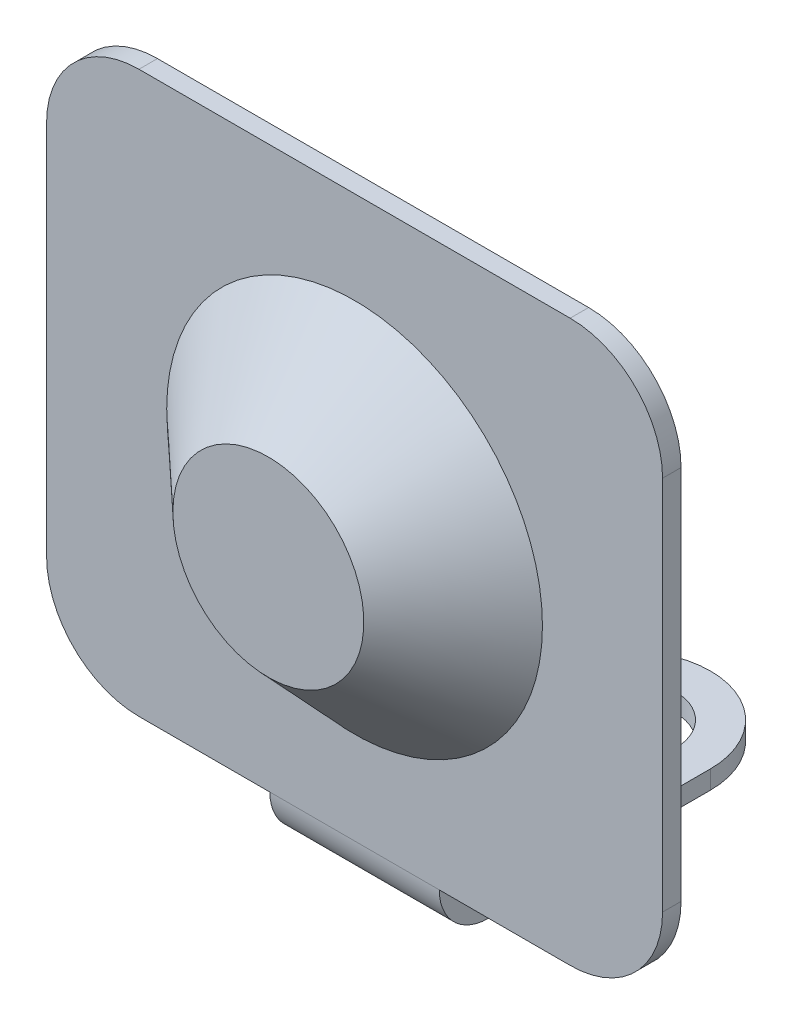
ISO-10303-21;
HEADER;
FILE_DESCRIPTION(('STEP AP214'),'2;1');
FILE_NAME('part.step','',(''),(''),'','','');
FILE_SCHEMA(('AUTOMOTIVE_DESIGN { 1 0 10303 214 1 1 1 1 }'));
ENDSEC;
DATA;
#1=APPLICATION_CONTEXT('core data for automotive mechanical design processes');
#2=APPLICATION_PROTOCOL_DEFINITION('international standard','automotive_design',2000,#1);
#3=PRODUCT_CONTEXT('',#1,'mechanical');
#4=PRODUCT('Part','Part','',(#3));
#5=PRODUCT_RELATED_PRODUCT_CATEGORY('part','',(#4));
#6=PRODUCT_DEFINITION_FORMATION('','',#4);
#7=PRODUCT_DEFINITION_CONTEXT('part definition',#1,'design');
#8=PRODUCT_DEFINITION('design','',#6,#7);
#9=PRODUCT_DEFINITION_SHAPE('','',#8);
#10=(LENGTH_UNIT() NAMED_UNIT(*) SI_UNIT(.MILLI.,.METRE.));
#11=(NAMED_UNIT(*) PLANE_ANGLE_UNIT() SI_UNIT($,.RADIAN.));
#12=(NAMED_UNIT(*) SI_UNIT($,.STERADIAN.) SOLID_ANGLE_UNIT());
#13=UNCERTAINTY_MEASURE_WITH_UNIT(LENGTH_MEASURE(1.E-05),#10,'distance_accuracy_value','');
#14=(GEOMETRIC_REPRESENTATION_CONTEXT(3) GLOBAL_UNCERTAINTY_ASSIGNED_CONTEXT((#13)) GLOBAL_UNIT_ASSIGNED_CONTEXT((#10,
#11,#12)) REPRESENTATION_CONTEXT('',''));
#15=CARTESIAN_POINT('',(0.,0.,0.));
#16=DIRECTION('',(0.,0.,1.));
#17=DIRECTION('',(1.,0.,0.));
#18=AXIS2_PLACEMENT_3D('',#15,#16,#17);
#19=CARTESIAN_POINT('',(0.,-5.05000000000002,5.07101761241668));
#20=DIRECTION('',(0.,1.,0.));
#21=DIRECTION('',(-1.,0.,0.));
#22=AXIS2_PLACEMENT_3D('',#19,#20,#21);
#23=PLANE('',#22);
#24=CARTESIAN_POINT('',(0.,-5.04999999999999,-4.10398238758332));
#25=DIRECTION('',(0.,1.,0.));
#26=DIRECTION('',(0.,0.,1.));
#27=AXIS2_PLACEMENT_3D('',#24,#25,#26);
#28=CIRCLE('',#27,0.8);
#29=CARTESIAN_POINT('',(0.,-5.04999999999999,-3.30398238758332));
#30=VERTEX_POINT('',#29);
#31=EDGE_CURVE('E194',#30,#30,#28,.T.);
#32=ORIENTED_EDGE('',*,*,#31,.F.);
#33=EDGE_LOOP('',(#32));
#34=FACE_BOUND('',#33,.T.);
#35=DIRECTION('',(0.,0.,-1.));
#36=VECTOR('',#35,1.);
#37=CARTESIAN_POINT('',(-1.375,-5.05000000000002,5.07101761241668));
#38=LINE('',#37,#36);
#39=CARTESIAN_POINT('',(-1.375,-5.05,-0.500000000000002));
#40=VERTEX_POINT('',#39);
#41=CARTESIAN_POINT('',(-1.375,-5.04999999999999,-4.10398238758332));
#42=VERTEX_POINT('',#41);
#43=EDGE_CURVE('E197',#40,#42,#38,.T.);
#44=ORIENTED_EDGE('',*,*,#43,.F.);
#45=DIRECTION('',(1.,0.,0.));
#46=VECTOR('',#45,1.);
#47=CARTESIAN_POINT('',(0.,-5.05,-0.500000000000001));
#48=LINE('',#47,#46);
#49=CARTESIAN_POINT('',(1.375,-5.05,-0.500000000000002));
#50=VERTEX_POINT('',#49);
#51=EDGE_CURVE('E155',#40,#50,#48,.T.);
#52=ORIENTED_EDGE('',*,*,#51,.T.);
#53=DIRECTION('',(0.,0.,1.));
#54=VECTOR('',#53,1.);
#55=CARTESIAN_POINT('',(1.375,-5.05000000000002,5.07101761241668));
#56=LINE('',#55,#54);
#57=CARTESIAN_POINT('',(1.375,-5.04999999999999,-4.10398238758332));
#58=VERTEX_POINT('',#57);
#59=EDGE_CURVE('E149',#58,#50,#56,.T.);
#60=ORIENTED_EDGE('',*,*,#59,.F.);
#61=CARTESIAN_POINT('',(0.,-5.04999999999999,-4.10398238758332));
#62=DIRECTION('',(0.,-1.,0.));
#63=DIRECTION('',(1.,0.,0.));
#64=AXIS2_PLACEMENT_3D('',#61,#62,#63);
#65=CIRCLE('',#64,1.375);
#66=EDGE_CURVE('E225',#42,#58,#65,.T.);
#67=ORIENTED_EDGE('',*,*,#66,.F.);
#68=EDGE_LOOP('',(#44,#52,#60,#67));
#69=FACE_BOUND('',#68,.T.);
#70=ADVANCED_FACE('F41',(#34,#69),#23,.T.);
#71=CARTESIAN_POINT('',(0.,-5.35000000000002,5.07101761241668));
#72=DIRECTION('',(0.,1.,0.));
#73=DIRECTION('',(-1.,0.,0.));
#74=AXIS2_PLACEMENT_3D('',#71,#72,#73);
#75=PLANE('',#74);
#76=CARTESIAN_POINT('',(0.,-5.34999999999999,-4.10398238758332));
#77=DIRECTION('',(0.,-1.,0.));
#78=DIRECTION('',(0.,0.,-1.));
#79=AXIS2_PLACEMENT_3D('',#76,#77,#78);
#80=CIRCLE('',#79,0.8);
#81=CARTESIAN_POINT('',(0.,-5.34999999999998,-4.90398238758332));
#82=VERTEX_POINT('',#81);
#83=EDGE_CURVE('E564',#82,#82,#80,.T.);
#84=ORIENTED_EDGE('',*,*,#83,.F.);
#85=EDGE_LOOP('',(#84));
#86=FACE_BOUND('',#85,.T.);
#87=DIRECTION('',(1.,0.,0.));
#88=VECTOR('',#87,1.);
#89=CARTESIAN_POINT('',(0.,-5.35,-0.500000000000004));
#90=LINE('',#89,#88);
#91=CARTESIAN_POINT('',(-1.375,-5.35,-0.500000000000003));
#92=VERTEX_POINT('',#91);
#93=CARTESIAN_POINT('',(1.375,-5.35,-0.500000000000002));
#94=VERTEX_POINT('',#93);
#95=EDGE_CURVE('E156',#92,#94,#90,.T.);
#96=ORIENTED_EDGE('',*,*,#95,.F.);
#97=DIRECTION('',(0.,0.,-1.));
#98=VECTOR('',#97,1.);
#99=CARTESIAN_POINT('',(-1.375,-5.35000000000002,5.07101761241668));
#100=LINE('',#99,#98);
#101=CARTESIAN_POINT('',(-1.375,-5.34999999999999,-4.10398238758332));
#102=VERTEX_POINT('',#101);
#103=EDGE_CURVE('E224',#92,#102,#100,.T.);
#104=ORIENTED_EDGE('',*,*,#103,.T.);
#105=CARTESIAN_POINT('',(0.,-5.34999999999999,-4.10398238758332));
#106=DIRECTION('',(0.,-1.,0.));
#107=DIRECTION('',(1.,0.,0.));
#108=AXIS2_PLACEMENT_3D('',#105,#106,#107);
#109=CIRCLE('',#108,1.375);
#110=CARTESIAN_POINT('',(1.375,-5.34999999999999,-4.10398238758332));
#111=VERTEX_POINT('',#110);
#112=EDGE_CURVE('E163',#102,#111,#109,.T.);
#113=ORIENTED_EDGE('',*,*,#112,.T.);
#114=DIRECTION('',(0.,0.,1.));
#115=VECTOR('',#114,1.);
#116=CARTESIAN_POINT('',(1.375,-5.35000000000002,5.07101761241668));
#117=LINE('',#116,#115);
#118=EDGE_CURVE('E147',#111,#94,#117,.T.);
#119=ORIENTED_EDGE('',*,*,#118,.T.);
#120=EDGE_LOOP('',(#96,#104,#113,#119));
#121=FACE_BOUND('',#120,.T.);
#122=ADVANCED_FACE('F160',(#86,#121),#75,.F.);
#123=CARTESIAN_POINT('',(-1.375,-5.35000000000002,5.07101761241668));
#124=DIRECTION('',(1.,0.,0.));
#125=DIRECTION('',(0.,0.,1.));
#126=AXIS2_PLACEMENT_3D('',#123,#124,#125);
#127=PLANE('',#126);
#128=DIRECTION('',(0.,-1.,0.));
#129=VECTOR('',#128,1.);
#130=CARTESIAN_POINT('',(-1.375,-5.34999999999996,-0.500000000000004));
#131=LINE('',#130,#129);
#132=EDGE_CURVE('E231',#40,#92,#131,.T.);
#133=ORIENTED_EDGE('',*,*,#132,.F.);
#134=ORIENTED_EDGE('',*,*,#43,.T.);
#135=DIRECTION('',(0.,1.,0.));
#136=VECTOR('',#135,1.);
#137=CARTESIAN_POINT('',(-1.375,-5.34999999999999,-4.10398238758332));
#138=LINE('',#137,#136);
#139=EDGE_CURVE('E175',#102,#42,#138,.T.);
#140=ORIENTED_EDGE('',*,*,#139,.F.);
#141=ORIENTED_EDGE('',*,*,#103,.F.);
#142=EDGE_LOOP('',(#133,#134,#140,#141));
#143=FACE_BOUND('',#142,.T.);
#144=ADVANCED_FACE('F323',(#143),#127,.F.);
#145=CARTESIAN_POINT('',(1.375,-5.35000000000002,5.07101761241668));
#146=DIRECTION('',(-1.,0.,0.));
#147=DIRECTION('',(0.,0.,-1.));
#148=AXIS2_PLACEMENT_3D('',#145,#146,#147);
#149=PLANE('',#148);
#150=DIRECTION('',(0.,1.,0.));
#151=VECTOR('',#150,1.);
#152=CARTESIAN_POINT('',(1.375,-5.34999999999996,-0.500000000000004));
#153=LINE('',#152,#151);
#154=EDGE_CURVE('E143',#94,#50,#153,.T.);
#155=ORIENTED_EDGE('',*,*,#154,.F.);
#156=ORIENTED_EDGE('',*,*,#118,.F.);
#157=DIRECTION('',(0.,1.,0.));
#158=VECTOR('',#157,1.);
#159=CARTESIAN_POINT('',(1.375,-5.34999999999999,-4.10398238758332));
#160=LINE('',#159,#158);
#161=EDGE_CURVE('E165',#111,#58,#160,.T.);
#162=ORIENTED_EDGE('',*,*,#161,.T.);
#163=ORIENTED_EDGE('',*,*,#59,.T.);
#164=EDGE_LOOP('',(#155,#156,#162,#163));
#165=FACE_BOUND('',#164,.T.);
#166=ADVANCED_FACE('F145',(#165),#149,.F.);
#167=CARTESIAN_POINT('',(0.,-5.34999999999999,-4.10398238758332));
#168=DIRECTION('',(0.,1.,0.));
#169=DIRECTION('',(-1.,0.,0.));
#170=AXIS2_PLACEMENT_3D('',#167,#168,#169);
#171=CYLINDRICAL_SURFACE('',#170,1.375);
#172=ORIENTED_EDGE('',*,*,#66,.T.);
#173=ORIENTED_EDGE('',*,*,#161,.F.);
#174=ORIENTED_EDGE('',*,*,#112,.F.);
#175=ORIENTED_EDGE('',*,*,#139,.T.);
#176=EDGE_LOOP('',(#172,#173,#174,#175));
#177=FACE_BOUND('',#176,.T.);
#178=ADVANCED_FACE('F422',(#177),#171,.T.);
#179=CARTESIAN_POINT('',(-5.,-4.55,0.3));
#180=DIRECTION('',(1.,0.,0.));
#181=DIRECTION('',(0.,0.,-1.));
#182=AXIS2_PLACEMENT_3D('',#179,#180,#181);
#183=PLANE('',#182);
#184=DIRECTION('',(0.,-1.,0.));
#185=VECTOR('',#184,1.);
#186=CARTESIAN_POINT('',(-5.,-4.55,0.));
#187=LINE('',#186,#185);
#188=CARTESIAN_POINT('',(-5.,3.05,0.));
#189=VERTEX_POINT('',#188);
#190=CARTESIAN_POINT('',(-5.,-3.05,0.));
#191=VERTEX_POINT('',#190);
#192=EDGE_CURVE('E218',#189,#191,#187,.T.);
#193=ORIENTED_EDGE('',*,*,#192,.T.);
#194=DIRECTION('',(0.,0.,-1.));
#195=VECTOR('',#194,1.);
#196=CARTESIAN_POINT('',(-5.,-3.05,0.3));
#197=LINE('',#196,#195);
#198=CARTESIAN_POINT('',(-5.,-3.05,0.3));
#199=VERTEX_POINT('',#198);
#200=EDGE_CURVE('E49',#191,#199,#197,.F.);
#201=ORIENTED_EDGE('',*,*,#200,.T.);
#202=DIRECTION('',(0.,-1.,0.));
#203=VECTOR('',#202,1.);
#204=CARTESIAN_POINT('',(-5.,-4.55,0.3));
#205=LINE('',#204,#203);
#206=CARTESIAN_POINT('',(-5.,3.05,0.3));
#207=VERTEX_POINT('',#206);
#208=EDGE_CURVE('E199',#207,#199,#205,.T.);
#209=ORIENTED_EDGE('',*,*,#208,.F.);
#210=DIRECTION('',(0.,0.,-1.));
#211=VECTOR('',#210,1.);
#212=CARTESIAN_POINT('',(-5.,3.05,0.3));
#213=LINE('',#212,#211);
#214=EDGE_CURVE('E267',#207,#189,#213,.T.);
#215=ORIENTED_EDGE('',*,*,#214,.T.);
#216=EDGE_LOOP('',(#193,#201,#209,#215));
#217=FACE_BOUND('',#216,.T.);
#218=ADVANCED_FACE('F271',(#217),#183,.F.);
#219=CARTESIAN_POINT('',(-5.,4.55,0.3));
#220=DIRECTION('',(0.,-1.,0.));
#221=DIRECTION('',(0.,0.,-1.));
#222=AXIS2_PLACEMENT_3D('',#219,#220,#221);
#223=PLANE('',#222);
#224=DIRECTION('',(-1.,0.,0.));
#225=VECTOR('',#224,1.);
#226=CARTESIAN_POINT('',(-5.,4.55,0.3));
#227=LINE('',#226,#225);
#228=CARTESIAN_POINT('',(3.5,4.55,0.3));
#229=VERTEX_POINT('',#228);
#230=CARTESIAN_POINT('',(-3.5,4.55,0.3));
#231=VERTEX_POINT('',#230);
#232=EDGE_CURVE('E201',#229,#231,#227,.T.);
#233=ORIENTED_EDGE('',*,*,#232,.F.);
#234=DIRECTION('',(0.,0.,-1.));
#235=VECTOR('',#234,1.);
#236=CARTESIAN_POINT('',(3.5,4.55,0.3));
#237=LINE('',#236,#235);
#238=CARTESIAN_POINT('',(3.5,4.55,0.));
#239=VERTEX_POINT('',#238);
#240=EDGE_CURVE('E239',#229,#239,#237,.T.);
#241=ORIENTED_EDGE('',*,*,#240,.T.);
#242=DIRECTION('',(-1.,0.,0.));
#243=VECTOR('',#242,1.);
#244=CARTESIAN_POINT('',(-5.,4.55,0.));
#245=LINE('',#244,#243);
#246=CARTESIAN_POINT('',(-3.5,4.55,0.));
#247=VERTEX_POINT('',#246);
#248=EDGE_CURVE('E215',#239,#247,#245,.T.);
#249=ORIENTED_EDGE('',*,*,#248,.T.);
#250=DIRECTION('',(0.,0.,-1.));
#251=VECTOR('',#250,1.);
#252=CARTESIAN_POINT('',(-3.5,4.55,0.3));
#253=LINE('',#252,#251);
#254=EDGE_CURVE('E234',#247,#231,#253,.F.);
#255=ORIENTED_EDGE('',*,*,#254,.T.);
#256=EDGE_LOOP('',(#233,#241,#249,#255));
#257=FACE_BOUND('',#256,.T.);
#258=ADVANCED_FACE('F306',(#257),#223,.F.);
#259=CARTESIAN_POINT('',(5.,-4.55,0.3));
#260=DIRECTION('',(-1.,0.,0.));
#261=DIRECTION('',(0.,0.,1.));
#262=AXIS2_PLACEMENT_3D('',#259,#260,#261);
#263=PLANE('',#262);
#264=DIRECTION('',(0.,1.,0.));
#265=VECTOR('',#264,1.);
#266=CARTESIAN_POINT('',(5.,-4.55,0.));
#267=LINE('',#266,#265);
#268=CARTESIAN_POINT('',(5.,-3.05,0.));
#269=VERTEX_POINT('',#268);
#270=CARTESIAN_POINT('',(5.,3.05,0.));
#271=VERTEX_POINT('',#270);
#272=EDGE_CURVE('E210',#269,#271,#267,.T.);
#273=ORIENTED_EDGE('',*,*,#272,.T.);
#274=DIRECTION('',(0.,0.,-1.));
#275=VECTOR('',#274,1.);
#276=CARTESIAN_POINT('',(5.,3.05,0.3));
#277=LINE('',#276,#275);
#278=CARTESIAN_POINT('',(5.,3.05,0.3));
#279=VERTEX_POINT('',#278);
#280=EDGE_CURVE('E253',#271,#279,#277,.F.);
#281=ORIENTED_EDGE('',*,*,#280,.T.);
#282=DIRECTION('',(0.,1.,0.));
#283=VECTOR('',#282,1.);
#284=CARTESIAN_POINT('',(5.,-4.55,0.3));
#285=LINE('',#284,#283);
#286=CARTESIAN_POINT('',(5.,-3.05,0.3));
#287=VERTEX_POINT('',#286);
#288=EDGE_CURVE('E203',#287,#279,#285,.T.);
#289=ORIENTED_EDGE('',*,*,#288,.F.);
#290=DIRECTION('',(0.,0.,-1.));
#291=VECTOR('',#290,1.);
#292=CARTESIAN_POINT('',(5.,-3.05,0.3));
#293=LINE('',#292,#291);
#294=EDGE_CURVE('E250',#287,#269,#293,.T.);
#295=ORIENTED_EDGE('',*,*,#294,.T.);
#296=EDGE_LOOP('',(#273,#281,#289,#295));
#297=FACE_BOUND('',#296,.T.);
#298=ADVANCED_FACE('F297',(#297),#263,.F.);
#299=CARTESIAN_POINT('',(0.,0.,0.3));
#300=DIRECTION('',(0.,0.,-1.));
#301=DIRECTION('',(-1.,0.,0.));
#302=AXIS2_PLACEMENT_3D('',#299,#300,#301);
#303=PLANE('',#302);
#304=CARTESIAN_POINT('',(0.,0.,0.3));
#305=DIRECTION('',(0.,0.,-1.));
#306=DIRECTION('',(-1.,0.,0.));
#307=AXIS2_PLACEMENT_3D('',#304,#305,#306);
#308=CIRCLE('',#307,3.04999999999999);
#309=CARTESIAN_POINT('',(-3.04999999999999,0.,0.3));
#310=VERTEX_POINT('',#309);
#311=EDGE_CURVE('E12',#310,#310,#308,.F.);
#312=ORIENTED_EDGE('',*,*,#311,.F.);
#313=EDGE_LOOP('',(#312));
#314=FACE_BOUND('',#313,.T.);
#315=ORIENTED_EDGE('',*,*,#288,.T.);
#316=CARTESIAN_POINT('',(3.5,3.05,0.3));
#317=DIRECTION('',(0.,0.,-1.));
#318=DIRECTION('',(-1.,0.,0.));
#319=AXIS2_PLACEMENT_3D('',#316,#317,#318);
#320=CIRCLE('',#319,1.5);
#321=EDGE_CURVE('E260',#279,#229,#320,.F.);
#322=ORIENTED_EDGE('',*,*,#321,.T.);
#323=ORIENTED_EDGE('',*,*,#232,.T.);
#324=CARTESIAN_POINT('',(-3.5,3.05,0.3));
#325=DIRECTION('',(0.,0.,-1.));
#326=DIRECTION('',(-1.,0.,0.));
#327=AXIS2_PLACEMENT_3D('',#324,#325,#326);
#328=CIRCLE('',#327,1.5);
#329=EDGE_CURVE('E62',#231,#207,#328,.F.);
#330=ORIENTED_EDGE('',*,*,#329,.T.);
#331=ORIENTED_EDGE('',*,*,#208,.T.);
#332=CARTESIAN_POINT('',(-3.5,-3.05,0.3));
#333=DIRECTION('',(0.,0.,-1.));
#334=DIRECTION('',(-1.,0.,0.));
#335=AXIS2_PLACEMENT_3D('',#332,#333,#334);
#336=CIRCLE('',#335,1.5);
#337=CARTESIAN_POINT('',(-3.5,-4.55,0.3));
#338=VERTEX_POINT('',#337);
#339=EDGE_CURVE('E256',#199,#338,#336,.F.);
#340=ORIENTED_EDGE('',*,*,#339,.T.);
#341=DIRECTION('',(1.,0.,0.));
#342=VECTOR('',#341,1.);
#343=CARTESIAN_POINT('',(-5.,-4.55,0.3));
#344=LINE('',#343,#342);
#345=CARTESIAN_POINT('',(-1.375,-4.55,0.3));
#346=VERTEX_POINT('',#345);
#347=EDGE_CURVE('E207',#338,#346,#344,.T.);
#348=ORIENTED_EDGE('',*,*,#347,.T.);
#349=DIRECTION('',(1.,0.,0.));
#350=VECTOR('',#349,1.);
#351=CARTESIAN_POINT('',(0.,-4.55,0.3));
#352=LINE('',#351,#350);
#353=CARTESIAN_POINT('',(1.375,-4.55,0.3));
#354=VERTEX_POINT('',#353);
#355=EDGE_CURVE('E209',#346,#354,#352,.T.);
#356=ORIENTED_EDGE('',*,*,#355,.T.);
#357=CARTESIAN_POINT('',(3.5,-4.55,0.3));
#358=VERTEX_POINT('',#357);
#359=EDGE_CURVE('E206',#354,#358,#344,.T.);
#360=ORIENTED_EDGE('',*,*,#359,.T.);
#361=CARTESIAN_POINT('',(3.5,-3.05,0.3));
#362=DIRECTION('',(0.,0.,-1.));
#363=DIRECTION('',(-1.,0.,0.));
#364=AXIS2_PLACEMENT_3D('',#361,#362,#363);
#365=CIRCLE('',#364,1.5);
#366=EDGE_CURVE('E258',#358,#287,#365,.F.);
#367=ORIENTED_EDGE('',*,*,#366,.T.);
#368=EDGE_LOOP('',(#315,#322,#323,#330,#331,#340,#348,#356,#360,#367));
#369=FACE_BOUND('',#368,.T.);
#370=ADVANCED_FACE('F286',(#314,#369),#303,.F.);
#371=CARTESIAN_POINT('',(-5.,-4.55,0.3));
#372=DIRECTION('',(0.,1.,0.));
#373=DIRECTION('',(0.,0.,1.));
#374=AXIS2_PLACEMENT_3D('',#371,#372,#373);
#375=PLANE('',#374);
#376=DIRECTION('',(1.,0.,0.));
#377=VECTOR('',#376,1.);
#378=CARTESIAN_POINT('',(-5.,-4.55,0.));
#379=LINE('',#378,#377);
#380=CARTESIAN_POINT('',(1.375,-4.55,0.));
#381=VERTEX_POINT('',#380);
#382=CARTESIAN_POINT('',(3.5,-4.55,0.));
#383=VERTEX_POINT('',#382);
#384=EDGE_CURVE('E198',#381,#383,#379,.T.);
#385=ORIENTED_EDGE('',*,*,#384,.T.);
#386=DIRECTION('',(0.,0.,-1.));
#387=VECTOR('',#386,1.);
#388=CARTESIAN_POINT('',(3.5,-4.55,0.3));
#389=LINE('',#388,#387);
#390=EDGE_CURVE('E262',#383,#358,#389,.F.);
#391=ORIENTED_EDGE('',*,*,#390,.T.);
#392=ORIENTED_EDGE('',*,*,#359,.F.);
#393=DIRECTION('',(0.,0.,1.));
#394=VECTOR('',#393,1.);
#395=CARTESIAN_POINT('',(1.375,-4.55,0.3));
#396=LINE('',#395,#394);
#397=EDGE_CURVE('E180',#381,#354,#396,.T.);
#398=ORIENTED_EDGE('',*,*,#397,.F.);
#399=EDGE_LOOP('',(#385,#391,#392,#398));
#400=FACE_BOUND('',#399,.T.);
#401=ADVANCED_FACE('F382',(#400),#375,.F.);
#402=CARTESIAN_POINT('',(0.,0.,0.));
#403=DIRECTION('',(0.,0.,-1.));
#404=DIRECTION('',(-1.,0.,0.));
#405=AXIS2_PLACEMENT_3D('',#402,#403,#404);
#406=PLANE('',#405);
#407=ORIENTED_EDGE('',*,*,#248,.F.);
#408=CARTESIAN_POINT('',(3.5,3.05,0.));
#409=DIRECTION('',(0.,0.,-1.));
#410=DIRECTION('',(-1.,0.,0.));
#411=AXIS2_PLACEMENT_3D('',#408,#409,#410);
#412=CIRCLE('',#411,1.5);
#413=EDGE_CURVE('E248',#239,#271,#412,.T.);
#414=ORIENTED_EDGE('',*,*,#413,.T.);
#415=ORIENTED_EDGE('',*,*,#272,.F.);
#416=CARTESIAN_POINT('',(3.5,-3.05,0.));
#417=DIRECTION('',(0.,0.,-1.));
#418=DIRECTION('',(-1.,0.,0.));
#419=AXIS2_PLACEMENT_3D('',#416,#417,#418);
#420=CIRCLE('',#419,1.5);
#421=EDGE_CURVE('E246',#269,#383,#420,.T.);
#422=ORIENTED_EDGE('',*,*,#421,.T.);
#423=ORIENTED_EDGE('',*,*,#384,.F.);
#424=DIRECTION('',(1.,0.,0.));
#425=VECTOR('',#424,1.);
#426=CARTESIAN_POINT('',(0.,-4.55,0.));
#427=LINE('',#426,#425);
#428=CARTESIAN_POINT('',(-1.375,-4.55,0.));
#429=VERTEX_POINT('',#428);
#430=EDGE_CURVE('E184',#429,#381,#427,.T.);
#431=ORIENTED_EDGE('',*,*,#430,.F.);
#432=CARTESIAN_POINT('',(-3.5,-4.55,0.));
#433=VERTEX_POINT('',#432);
#434=EDGE_CURVE('E195',#433,#429,#379,.T.);
#435=ORIENTED_EDGE('',*,*,#434,.F.);
#436=CARTESIAN_POINT('',(-3.5,-3.05,0.));
#437=DIRECTION('',(0.,0.,-1.));
#438=DIRECTION('',(-1.,0.,0.));
#439=AXIS2_PLACEMENT_3D('',#436,#437,#438);
#440=CIRCLE('',#439,1.5);
#441=EDGE_CURVE('E244',#433,#191,#440,.T.);
#442=ORIENTED_EDGE('',*,*,#441,.T.);
#443=ORIENTED_EDGE('',*,*,#192,.F.);
#444=CARTESIAN_POINT('',(-3.5,3.05,0.));
#445=DIRECTION('',(0.,0.,-1.));
#446=DIRECTION('',(-1.,0.,0.));
#447=AXIS2_PLACEMENT_3D('',#444,#445,#446);
#448=CIRCLE('',#447,1.5);
#449=EDGE_CURVE('E242',#189,#247,#448,.T.);
#450=ORIENTED_EDGE('',*,*,#449,.T.);
#451=EDGE_LOOP('',(#407,#414,#415,#422,#423,#431,#435,#442,#443,#450));
#452=FACE_BOUND('',#451,.T.);
#453=ADVANCED_FACE('F275',(#452),#406,.T.);
#454=ORIENTED_EDGE('',*,*,#347,.F.);
#455=DIRECTION('',(0.,0.,-1.));
#456=VECTOR('',#455,1.);
#457=CARTESIAN_POINT('',(-3.5,-4.55,0.3));
#458=LINE('',#457,#456);
#459=EDGE_CURVE('E264',#338,#433,#458,.T.);
#460=ORIENTED_EDGE('',*,*,#459,.T.);
#461=ORIENTED_EDGE('',*,*,#434,.T.);
#462=DIRECTION('',(0.,0.,-1.));
#463=VECTOR('',#462,1.);
#464=CARTESIAN_POINT('',(-1.375,-4.55,0.3));
#465=LINE('',#464,#463);
#466=EDGE_CURVE('E181',#346,#429,#465,.T.);
#467=ORIENTED_EDGE('',*,*,#466,.F.);
#468=EDGE_LOOP('',(#454,#460,#461,#467));
#469=FACE_BOUND('',#468,.T.);
#470=ADVANCED_FACE('F284',(#469),#375,.F.);
#471=CARTESIAN_POINT('',(-1.375,-4.55,-0.5));
#472=DIRECTION('',(-1.,0.,0.));
#473=DIRECTION('',(0.,0.,1.));
#474=AXIS2_PLACEMENT_3D('',#471,#472,#473);
#475=PLANE('',#474);
#476=ORIENTED_EDGE('',*,*,#466,.T.);
#477=CARTESIAN_POINT('',(-1.375,-4.55,-0.5));
#478=DIRECTION('',(1.,0.,0.));
#479=DIRECTION('',(0.,0.,-1.));
#480=AXIS2_PLACEMENT_3D('',#477,#478,#479);
#481=CIRCLE('',#480,0.5);
#482=EDGE_CURVE('E191',#429,#40,#481,.T.);
#483=ORIENTED_EDGE('',*,*,#482,.T.);
#484=ORIENTED_EDGE('',*,*,#132,.T.);
#485=CARTESIAN_POINT('',(-1.375,-4.55,-0.5));
#486=DIRECTION('',(1.,0.,0.));
#487=DIRECTION('',(0.,0.,-1.));
#488=AXIS2_PLACEMENT_3D('',#485,#486,#487);
#489=CIRCLE('',#488,0.8);
#490=EDGE_CURVE('E174',#346,#92,#489,.T.);
#491=ORIENTED_EDGE('',*,*,#490,.F.);
#492=EDGE_LOOP('',(#476,#483,#484,#491));
#493=FACE_BOUND('',#492,.T.);
#494=ADVANCED_FACE('F416',(#493),#475,.T.);
#495=CARTESIAN_POINT('',(1.375,-4.55,-0.5));
#496=DIRECTION('',(1.,0.,0.));
#497=DIRECTION('',(0.,0.,-1.));
#498=AXIS2_PLACEMENT_3D('',#495,#496,#497);
#499=PLANE('',#498);
#500=ORIENTED_EDGE('',*,*,#154,.T.);
#501=CARTESIAN_POINT('',(1.375,-4.55,-0.5));
#502=DIRECTION('',(1.,0.,0.));
#503=DIRECTION('',(0.,0.,-1.));
#504=AXIS2_PLACEMENT_3D('',#501,#502,#503);
#505=CIRCLE('',#504,0.5);
#506=EDGE_CURVE('E186',#50,#381,#505,.F.);
#507=ORIENTED_EDGE('',*,*,#506,.T.);
#508=ORIENTED_EDGE('',*,*,#397,.T.);
#509=CARTESIAN_POINT('',(1.375,-4.55,-0.5));
#510=DIRECTION('',(-1.,0.,0.));
#511=DIRECTION('',(0.,0.,1.));
#512=AXIS2_PLACEMENT_3D('',#509,#510,#511);
#513=CIRCLE('',#512,0.8);
#514=EDGE_CURVE('E172',#94,#354,#513,.T.);
#515=ORIENTED_EDGE('',*,*,#514,.F.);
#516=EDGE_LOOP('',(#500,#507,#508,#515));
#517=FACE_BOUND('',#516,.T.);
#518=ADVANCED_FACE('F178',(#517),#499,.T.);
#519=CARTESIAN_POINT('',(-2.94872463361113,-4.55,-0.5));
#520=DIRECTION('',(1.,0.,0.));
#521=DIRECTION('',(0.,0.,-1.));
#522=AXIS2_PLACEMENT_3D('',#519,#520,#521);
#523=CYLINDRICAL_SURFACE('',#522,0.8);
#524=ORIENTED_EDGE('',*,*,#514,.T.);
#525=ORIENTED_EDGE('',*,*,#355,.F.);
#526=ORIENTED_EDGE('',*,*,#490,.T.);
#527=ORIENTED_EDGE('',*,*,#95,.T.);
#528=EDGE_LOOP('',(#524,#525,#526,#527));
#529=FACE_BOUND('',#528,.T.);
#530=ADVANCED_FACE('F170',(#529),#523,.T.);
#531=CARTESIAN_POINT('',(-2.94872463361113,-4.55,-0.5));
#532=DIRECTION('',(1.,0.,0.));
#533=DIRECTION('',(0.,0.,-1.));
#534=AXIS2_PLACEMENT_3D('',#531,#532,#533);
#535=CYLINDRICAL_SURFACE('',#534,0.5);
#536=ORIENTED_EDGE('',*,*,#506,.F.);
#537=ORIENTED_EDGE('',*,*,#51,.F.);
#538=ORIENTED_EDGE('',*,*,#482,.F.);
#539=ORIENTED_EDGE('',*,*,#430,.T.);
#540=EDGE_LOOP('',(#536,#537,#538,#539));
#541=FACE_BOUND('',#540,.T.);
#542=ADVANCED_FACE('F335',(#541),#535,.F.);
#543=CARTESIAN_POINT('',(3.5,3.05,0.3));
#544=DIRECTION('',(0.,0.,-1.));
#545=DIRECTION('',(-1.,0.,0.));
#546=AXIS2_PLACEMENT_3D('',#543,#544,#545);
#547=CYLINDRICAL_SURFACE('',#546,1.5);
#548=ORIENTED_EDGE('',*,*,#321,.F.);
#549=ORIENTED_EDGE('',*,*,#280,.F.);
#550=ORIENTED_EDGE('',*,*,#413,.F.);
#551=ORIENTED_EDGE('',*,*,#240,.F.);
#552=EDGE_LOOP('',(#548,#549,#550,#551));
#553=FACE_BOUND('',#552,.T.);
#554=ADVANCED_FACE('F303',(#553),#547,.T.);
#555=CARTESIAN_POINT('',(3.5,-3.05,0.3));
#556=DIRECTION('',(0.,0.,-1.));
#557=DIRECTION('',(-1.,0.,0.));
#558=AXIS2_PLACEMENT_3D('',#555,#556,#557);
#559=CYLINDRICAL_SURFACE('',#558,1.5);
#560=ORIENTED_EDGE('',*,*,#366,.F.);
#561=ORIENTED_EDGE('',*,*,#390,.F.);
#562=ORIENTED_EDGE('',*,*,#421,.F.);
#563=ORIENTED_EDGE('',*,*,#294,.F.);
#564=EDGE_LOOP('',(#560,#561,#562,#563));
#565=FACE_BOUND('',#564,.T.);
#566=ADVANCED_FACE('F294',(#565),#559,.T.);
#567=CARTESIAN_POINT('',(-3.5,-3.05,0.3));
#568=DIRECTION('',(0.,0.,-1.));
#569=DIRECTION('',(-1.,0.,0.));
#570=AXIS2_PLACEMENT_3D('',#567,#568,#569);
#571=CYLINDRICAL_SURFACE('',#570,1.5);
#572=ORIENTED_EDGE('',*,*,#339,.F.);
#573=ORIENTED_EDGE('',*,*,#200,.F.);
#574=ORIENTED_EDGE('',*,*,#441,.F.);
#575=ORIENTED_EDGE('',*,*,#459,.F.);
#576=EDGE_LOOP('',(#572,#573,#574,#575));
#577=FACE_BOUND('',#576,.T.);
#578=ADVANCED_FACE('F281',(#577),#571,.T.);
#579=CARTESIAN_POINT('',(-3.5,3.05,0.3));
#580=DIRECTION('',(0.,0.,-1.));
#581=DIRECTION('',(-1.,0.,0.));
#582=AXIS2_PLACEMENT_3D('',#579,#580,#581);
#583=CYLINDRICAL_SURFACE('',#582,1.5);
#584=ORIENTED_EDGE('',*,*,#329,.F.);
#585=ORIENTED_EDGE('',*,*,#254,.F.);
#586=ORIENTED_EDGE('',*,*,#449,.F.);
#587=ORIENTED_EDGE('',*,*,#214,.F.);
#588=EDGE_LOOP('',(#584,#585,#586,#587));
#589=FACE_BOUND('',#588,.T.);
#590=ADVANCED_FACE('F43',(#589),#583,.T.);
#591=CARTESIAN_POINT('',(0.,4.55000000000001,-4.10398238758328));
#592=DIRECTION('',(0.,-1.,0.));
#593=DIRECTION('',(0.,0.,-1.));
#594=AXIS2_PLACEMENT_3D('',#591,#592,#593);
#595=CYLINDRICAL_SURFACE('',#594,0.8);
#596=ORIENTED_EDGE('',*,*,#31,.T.);
#597=EDGE_LOOP('',(#596));
#598=FACE_BOUND('',#597,.T.);
#599=ORIENTED_EDGE('',*,*,#83,.T.);
#600=EDGE_LOOP('',(#599));
#601=FACE_BOUND('',#600,.T.);
#602=ADVANCED_FACE('F309',(#598,#601),#595,.F.);
#603=CARTESIAN_POINT('',(0.,0.,1.69999999999999));
#604=DIRECTION('',(0.,0.,-1.));
#605=DIRECTION('',(-1.,0.,0.));
#606=AXIS2_PLACEMENT_3D('',#603,#604,#605);
#607=CONICAL_SURFACE('',#606,1.55,0.819867264396957);
#608=ORIENTED_EDGE('',*,*,#311,.T.);
#609=EDGE_LOOP('',(#608));
#610=FACE_BOUND('',#609,.T.);
#611=CARTESIAN_POINT('',(0.,0.,1.69999999999999));
#612=DIRECTION('',(0.,0.,-1.));
#613=DIRECTION('',(-1.,0.,0.));
#614=AXIS2_PLACEMENT_3D('',#611,#612,#613);
#615=CIRCLE('',#614,1.55);
#616=CARTESIAN_POINT('',(-1.55,0.,1.69999999999999));
#617=VERTEX_POINT('',#616);
#618=EDGE_CURVE('E562',#617,#617,#615,.T.);
#619=ORIENTED_EDGE('',*,*,#618,.T.);
#620=EDGE_LOOP('',(#619));
#621=FACE_BOUND('',#620,.T.);
#622=ADVANCED_FACE('F314',(#610,#621),#607,.T.);
#623=CARTESIAN_POINT('',(1.55,0.,1.7));
#624=DIRECTION('',(0.,0.,-1.));
#625=DIRECTION('',(-1.,0.,0.));
#626=AXIS2_PLACEMENT_3D('',#623,#624,#625);
#627=PLANE('',#626);
#628=ORIENTED_EDGE('',*,*,#618,.F.);
#629=EDGE_LOOP('',(#628));
#630=FACE_BOUND('',#629,.T.);
#631=ADVANCED_FACE('F394',(#630),#627,.F.);
#632=CLOSED_SHELL('',(#70,#122,#144,#166,#178,#218,#258,#298,#370,#401,#453,#470,#494,#518,#530,
#542,#554,#566,#578,#590,#602,#622,#631));
#633=MANIFOLD_SOLID_BREP('B2',#632);
#634=ADVANCED_BREP_SHAPE_REPRESENTATION('',(#18,#633),#14);
#635=SHAPE_DEFINITION_REPRESENTATION(#9,#634);
ENDSEC;
END-ISO-10303-21;
